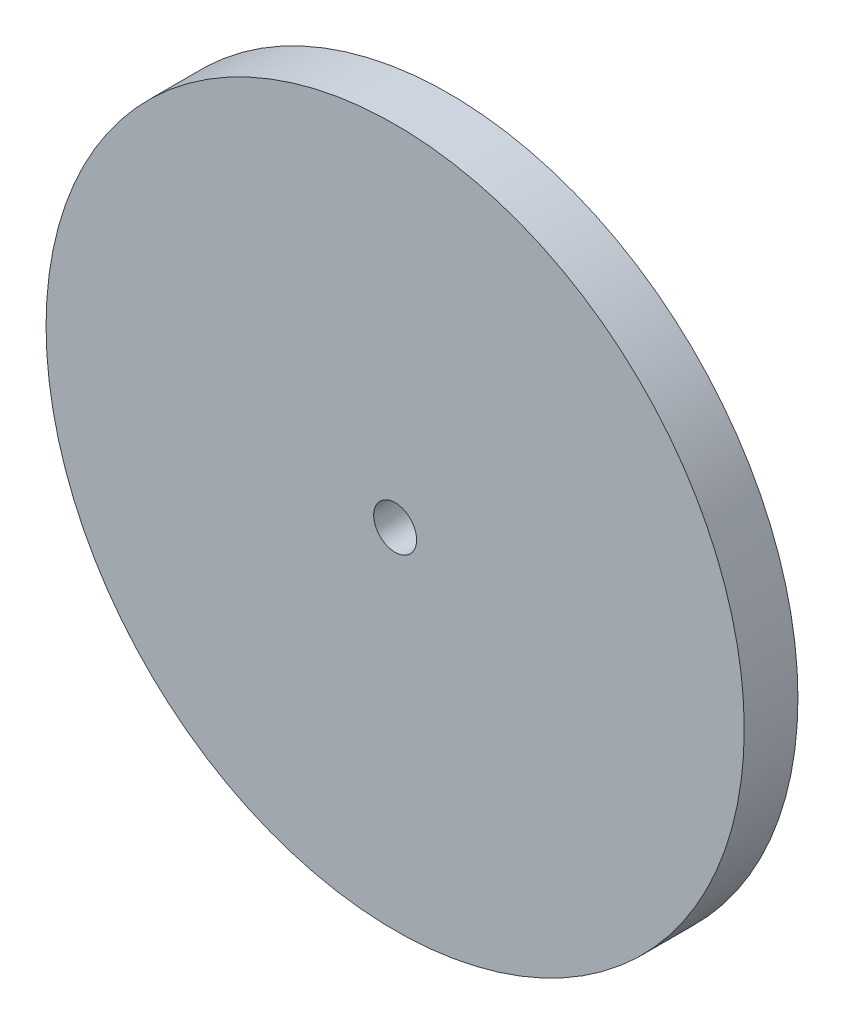
ISO-10303-21;
HEADER;
FILE_DESCRIPTION(('STEP AP214'),'2;1');
FILE_NAME('part.step','',(''),(''),'','','');
FILE_SCHEMA(('AUTOMOTIVE_DESIGN { 1 0 10303 214 1 1 1 1 }'));
ENDSEC;
DATA;
#1=APPLICATION_CONTEXT('core data for automotive mechanical design processes');
#2=APPLICATION_PROTOCOL_DEFINITION('international standard','automotive_design',2000,#1);
#3=PRODUCT_CONTEXT('',#1,'mechanical');
#4=PRODUCT('Part','Part','',(#3));
#5=PRODUCT_RELATED_PRODUCT_CATEGORY('part','',(#4));
#6=PRODUCT_DEFINITION_FORMATION('','',#4);
#7=PRODUCT_DEFINITION_CONTEXT('part definition',#1,'design');
#8=PRODUCT_DEFINITION('design','',#6,#7);
#9=PRODUCT_DEFINITION_SHAPE('','',#8);
#10=(LENGTH_UNIT() NAMED_UNIT(*) SI_UNIT(.MILLI.,.METRE.));
#11=(NAMED_UNIT(*) PLANE_ANGLE_UNIT() SI_UNIT($,.RADIAN.));
#12=(NAMED_UNIT(*) SI_UNIT($,.STERADIAN.) SOLID_ANGLE_UNIT());
#13=UNCERTAINTY_MEASURE_WITH_UNIT(LENGTH_MEASURE(1.E-05),#10,'distance_accuracy_value','');
#14=(GEOMETRIC_REPRESENTATION_CONTEXT(3) GLOBAL_UNCERTAINTY_ASSIGNED_CONTEXT((#13)) GLOBAL_UNIT_ASSIGNED_CONTEXT((#10,
#11,#12)) REPRESENTATION_CONTEXT('',''));
#15=CARTESIAN_POINT('',(0.,0.,0.));
#16=DIRECTION('',(0.,0.,1.));
#17=DIRECTION('',(1.,0.,0.));
#18=AXIS2_PLACEMENT_3D('',#15,#16,#17);
#19=CARTESIAN_POINT('',(0.,0.,1.));
#20=DIRECTION('',(0.,0.,1.));
#21=DIRECTION('',(1.,0.,0.));
#22=AXIS2_PLACEMENT_3D('',#19,#20,#21);
#23=PLANE('',#22);
#24=CARTESIAN_POINT('',(0.,0.,1.));
#25=DIRECTION('',(0.,0.,1.));
#26=DIRECTION('',(1.,0.,0.));
#27=AXIS2_PLACEMENT_3D('',#24,#25,#26);
#28=CIRCLE('',#27,6.5);
#29=CARTESIAN_POINT('',(6.5,0.,1.));
#30=VERTEX_POINT('',#29);
#31=EDGE_CURVE('E10',#30,#30,#28,.T.);
#32=ORIENTED_EDGE('',*,*,#31,.T.);
#33=EDGE_LOOP('',(#32));
#34=FACE_BOUND('',#33,.T.);
#35=CARTESIAN_POINT('',(0.,0.,1.));
#36=DIRECTION('',(0.,0.,1.));
#37=DIRECTION('',(1.,0.,0.));
#38=AXIS2_PLACEMENT_3D('',#35,#36,#37);
#39=CIRCLE('',#38,0.4);
#40=CARTESIAN_POINT('',(0.4,0.,1.));
#41=VERTEX_POINT('',#40);
#42=EDGE_CURVE('E50',#41,#41,#39,.T.);
#43=ORIENTED_EDGE('',*,*,#42,.F.);
#44=EDGE_LOOP('',(#43));
#45=FACE_BOUND('',#44,.T.);
#46=ADVANCED_FACE('F39',(#34,#45),#23,.T.);
#47=CARTESIAN_POINT('',(0.,0.,0.));
#48=DIRECTION('',(0.,0.,1.));
#49=DIRECTION('',(1.,0.,0.));
#50=AXIS2_PLACEMENT_3D('',#47,#48,#49);
#51=PLANE('',#50);
#52=CARTESIAN_POINT('',(0.,0.,0.));
#53=DIRECTION('',(0.,0.,1.));
#54=DIRECTION('',(1.,0.,0.));
#55=AXIS2_PLACEMENT_3D('',#52,#53,#54);
#56=CIRCLE('',#55,6.5);
#57=CARTESIAN_POINT('',(6.5,0.,0.));
#58=VERTEX_POINT('',#57);
#59=EDGE_CURVE('E43',#58,#58,#56,.T.);
#60=ORIENTED_EDGE('',*,*,#59,.F.);
#61=EDGE_LOOP('',(#60));
#62=FACE_BOUND('',#61,.T.);
#63=CARTESIAN_POINT('',(0.,0.,0.));
#64=DIRECTION('',(0.,0.,1.));
#65=DIRECTION('',(1.,0.,0.));
#66=AXIS2_PLACEMENT_3D('',#63,#64,#65);
#67=CIRCLE('',#66,0.4);
#68=CARTESIAN_POINT('',(0.4,0.,0.));
#69=VERTEX_POINT('',#68);
#70=EDGE_CURVE('E52',#69,#69,#67,.T.);
#71=ORIENTED_EDGE('',*,*,#70,.T.);
#72=EDGE_LOOP('',(#71));
#73=FACE_BOUND('',#72,.T.);
#74=ADVANCED_FACE('F62',(#62,#73),#51,.F.);
#75=CARTESIAN_POINT('',(0.,0.,1.));
#76=DIRECTION('',(0.,0.,-1.));
#77=DIRECTION('',(-1.,0.,0.));
#78=AXIS2_PLACEMENT_3D('',#75,#76,#77);
#79=CYLINDRICAL_SURFACE('',#78,6.5);
#80=ORIENTED_EDGE('',*,*,#31,.F.);
#81=EDGE_LOOP('',(#80));
#82=FACE_BOUND('',#81,.T.);
#83=ORIENTED_EDGE('',*,*,#59,.T.);
#84=EDGE_LOOP('',(#83));
#85=FACE_BOUND('',#84,.T.);
#86=ADVANCED_FACE('F41',(#82,#85),#79,.T.);
#87=CARTESIAN_POINT('',(0.,0.,1.));
#88=DIRECTION('',(0.,0.,-1.));
#89=DIRECTION('',(-1.,0.,0.));
#90=AXIS2_PLACEMENT_3D('',#87,#88,#89);
#91=CYLINDRICAL_SURFACE('',#90,0.4);
#92=ORIENTED_EDGE('',*,*,#42,.T.);
#93=EDGE_LOOP('',(#92));
#94=FACE_BOUND('',#93,.T.);
#95=ORIENTED_EDGE('',*,*,#70,.F.);
#96=EDGE_LOOP('',(#95));
#97=FACE_BOUND('',#96,.T.);
#98=ADVANCED_FACE('F58',(#94,#97),#91,.F.);
#99=CLOSED_SHELL('',(#46,#74,#86,#98));
#100=MANIFOLD_SOLID_BREP('B2',#99);
#101=ADVANCED_BREP_SHAPE_REPRESENTATION('',(#18,#100),#14);
#102=SHAPE_DEFINITION_REPRESENTATION(#9,#101);
ENDSEC;
END-ISO-10303-21;
